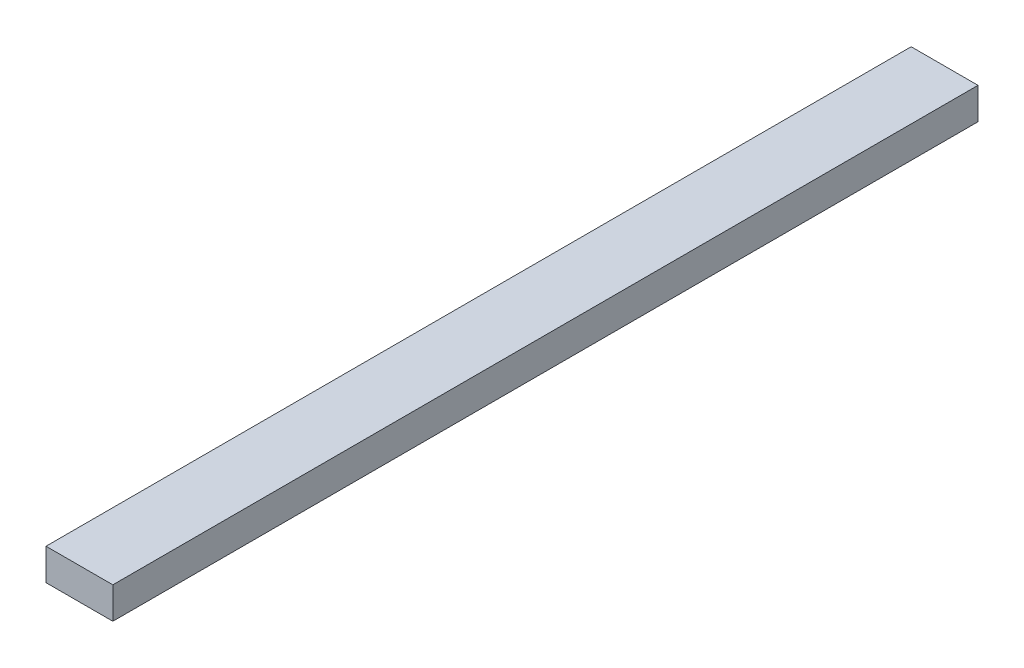
ISO-10303-21;
HEADER;
FILE_DESCRIPTION(('STEP AP214'),'2;1');
FILE_NAME('part.step','',(''),(''),'','','');
FILE_SCHEMA(('AUTOMOTIVE_DESIGN { 1 0 10303 214 1 1 1 1 }'));
ENDSEC;
DATA;
#1=APPLICATION_CONTEXT('core data for automotive mechanical design processes');
#2=APPLICATION_PROTOCOL_DEFINITION('international standard','automotive_design',2000,#1);
#3=PRODUCT_CONTEXT('',#1,'mechanical');
#4=PRODUCT('Part','Part','',(#3));
#5=PRODUCT_RELATED_PRODUCT_CATEGORY('part','',(#4));
#6=PRODUCT_DEFINITION_FORMATION('','',#4);
#7=PRODUCT_DEFINITION_CONTEXT('part definition',#1,'design');
#8=PRODUCT_DEFINITION('design','',#6,#7);
#9=PRODUCT_DEFINITION_SHAPE('','',#8);
#10=(LENGTH_UNIT() NAMED_UNIT(*) SI_UNIT(.MILLI.,.METRE.));
#11=(NAMED_UNIT(*) PLANE_ANGLE_UNIT() SI_UNIT($,.RADIAN.));
#12=(NAMED_UNIT(*) SI_UNIT($,.STERADIAN.) SOLID_ANGLE_UNIT());
#13=UNCERTAINTY_MEASURE_WITH_UNIT(LENGTH_MEASURE(1.E-05),#10,'distance_accuracy_value','');
#14=(GEOMETRIC_REPRESENTATION_CONTEXT(3) GLOBAL_UNCERTAINTY_ASSIGNED_CONTEXT((#13)) GLOBAL_UNIT_ASSIGNED_CONTEXT((#10,
#11,#12)) REPRESENTATION_CONTEXT('',''));
#15=CARTESIAN_POINT('',(0.,0.,0.));
#16=DIRECTION('',(0.,0.,1.));
#17=DIRECTION('',(1.,0.,0.));
#18=AXIS2_PLACEMENT_3D('',#15,#16,#17);
#19=CARTESIAN_POINT('',(-3.175,-1.5,82.2));
#20=DIRECTION('',(1.,0.,0.));
#21=DIRECTION('',(0.,0.,-1.));
#22=AXIS2_PLACEMENT_3D('',#19,#20,#21);
#23=PLANE('',#22);
#24=DIRECTION('',(0.,-1.,0.));
#25=VECTOR('',#24,1.);
#26=CARTESIAN_POINT('',(-3.175,-1.5,0.));
#27=LINE('',#26,#25);
#28=CARTESIAN_POINT('',(-3.175,1.5,0.));
#29=VERTEX_POINT('',#28);
#30=CARTESIAN_POINT('',(-3.175,-1.5,0.));
#31=VERTEX_POINT('',#30);
#32=EDGE_CURVE('E96',#29,#31,#27,.T.);
#33=ORIENTED_EDGE('',*,*,#32,.T.);
#34=DIRECTION('',(0.,0.,-1.));
#35=VECTOR('',#34,1.);
#36=CARTESIAN_POINT('',(-3.175,-1.5,82.2));
#37=LINE('',#36,#35);
#38=CARTESIAN_POINT('',(-3.175,-1.5,82.2));
#39=VERTEX_POINT('',#38);
#40=EDGE_CURVE('E11',#39,#31,#37,.T.);
#41=ORIENTED_EDGE('',*,*,#40,.F.);
#42=DIRECTION('',(0.,-1.,0.));
#43=VECTOR('',#42,1.);
#44=CARTESIAN_POINT('',(-3.175,-1.5,82.2));
#45=LINE('',#44,#43);
#46=CARTESIAN_POINT('',(-3.175,1.5,82.2));
#47=VERTEX_POINT('',#46);
#48=EDGE_CURVE('E84',#47,#39,#45,.T.);
#49=ORIENTED_EDGE('',*,*,#48,.F.);
#50=DIRECTION('',(0.,0.,-1.));
#51=VECTOR('',#50,1.);
#52=CARTESIAN_POINT('',(-3.175,1.5,82.2));
#53=LINE('',#52,#51);
#54=EDGE_CURVE('E92',#47,#29,#53,.T.);
#55=ORIENTED_EDGE('',*,*,#54,.T.);
#56=EDGE_LOOP('',(#33,#41,#49,#55));
#57=FACE_BOUND('',#56,.T.);
#58=ADVANCED_FACE('F33',(#57),#23,.F.);
#59=CARTESIAN_POINT('',(3.175,-1.5,82.2));
#60=DIRECTION('',(0.,1.,0.));
#61=DIRECTION('',(-1.,0.,0.));
#62=AXIS2_PLACEMENT_3D('',#59,#60,#61);
#63=PLANE('',#62);
#64=DIRECTION('',(1.,0.,0.));
#65=VECTOR('',#64,1.);
#66=CARTESIAN_POINT('',(3.175,-1.5,0.));
#67=LINE('',#66,#65);
#68=CARTESIAN_POINT('',(3.175,-1.5,0.));
#69=VERTEX_POINT('',#68);
#70=EDGE_CURVE('E88',#31,#69,#67,.T.);
#71=ORIENTED_EDGE('',*,*,#70,.T.);
#72=DIRECTION('',(0.,0.,-1.));
#73=VECTOR('',#72,1.);
#74=CARTESIAN_POINT('',(3.175,-1.5,82.2));
#75=LINE('',#74,#73);
#76=CARTESIAN_POINT('',(3.175,-1.5,82.2));
#77=VERTEX_POINT('',#76);
#78=EDGE_CURVE('E41',#77,#69,#75,.T.);
#79=ORIENTED_EDGE('',*,*,#78,.F.);
#80=DIRECTION('',(1.,0.,0.));
#81=VECTOR('',#80,1.);
#82=CARTESIAN_POINT('',(3.175,-1.5,82.2));
#83=LINE('',#82,#81);
#84=EDGE_CURVE('E79',#39,#77,#83,.T.);
#85=ORIENTED_EDGE('',*,*,#84,.F.);
#86=ORIENTED_EDGE('',*,*,#40,.T.);
#87=EDGE_LOOP('',(#71,#79,#85,#86));
#88=FACE_BOUND('',#87,.T.);
#89=ADVANCED_FACE('F87',(#88),#63,.F.);
#90=CARTESIAN_POINT('',(3.175,-1.5,82.2));
#91=DIRECTION('',(-1.,0.,0.));
#92=DIRECTION('',(0.,0.,1.));
#93=AXIS2_PLACEMENT_3D('',#90,#91,#92);
#94=PLANE('',#93);
#95=DIRECTION('',(0.,1.,0.));
#96=VECTOR('',#95,1.);
#97=CARTESIAN_POINT('',(3.175,-1.5,0.));
#98=LINE('',#97,#96);
#99=CARTESIAN_POINT('',(3.175,1.5,0.));
#100=VERTEX_POINT('',#99);
#101=EDGE_CURVE('E66',#69,#100,#98,.T.);
#102=ORIENTED_EDGE('',*,*,#101,.T.);
#103=DIRECTION('',(0.,0.,-1.));
#104=VECTOR('',#103,1.);
#105=CARTESIAN_POINT('',(3.175,1.5,82.2));
#106=LINE('',#105,#104);
#107=CARTESIAN_POINT('',(3.175,1.5,82.2));
#108=VERTEX_POINT('',#107);
#109=EDGE_CURVE('E89',#108,#100,#106,.T.);
#110=ORIENTED_EDGE('',*,*,#109,.F.);
#111=DIRECTION('',(0.,1.,0.));
#112=VECTOR('',#111,1.);
#113=CARTESIAN_POINT('',(3.175,-1.5,82.2));
#114=LINE('',#113,#112);
#115=EDGE_CURVE('E82',#77,#108,#114,.T.);
#116=ORIENTED_EDGE('',*,*,#115,.F.);
#117=ORIENTED_EDGE('',*,*,#78,.T.);
#118=EDGE_LOOP('',(#102,#110,#116,#117));
#119=FACE_BOUND('',#118,.T.);
#120=ADVANCED_FACE('F90',(#119),#94,.F.);
#121=CARTESIAN_POINT('',(3.175,1.5,82.2));
#122=DIRECTION('',(0.,-1.,0.));
#123=DIRECTION('',(1.,0.,0.));
#124=AXIS2_PLACEMENT_3D('',#121,#122,#123);
#125=PLANE('',#124);
#126=DIRECTION('',(-1.,0.,0.));
#127=VECTOR('',#126,1.);
#128=CARTESIAN_POINT('',(3.175,1.5,0.));
#129=LINE('',#128,#127);
#130=EDGE_CURVE('E72',#100,#29,#129,.T.);
#131=ORIENTED_EDGE('',*,*,#130,.T.);
#132=ORIENTED_EDGE('',*,*,#54,.F.);
#133=DIRECTION('',(-1.,0.,0.));
#134=VECTOR('',#133,1.);
#135=CARTESIAN_POINT('',(3.175,1.5,82.2));
#136=LINE('',#135,#134);
#137=EDGE_CURVE('E49',#108,#47,#136,.T.);
#138=ORIENTED_EDGE('',*,*,#137,.F.);
#139=ORIENTED_EDGE('',*,*,#109,.T.);
#140=EDGE_LOOP('',(#131,#132,#138,#139));
#141=FACE_BOUND('',#140,.T.);
#142=ADVANCED_FACE('F103',(#141),#125,.F.);
#143=CARTESIAN_POINT('',(0.,0.,82.2));
#144=DIRECTION('',(0.,0.,1.));
#145=DIRECTION('',(1.,0.,0.));
#146=AXIS2_PLACEMENT_3D('',#143,#144,#145);
#147=PLANE('',#146);
#148=ORIENTED_EDGE('',*,*,#48,.T.);
#149=ORIENTED_EDGE('',*,*,#84,.T.);
#150=ORIENTED_EDGE('',*,*,#115,.T.);
#151=ORIENTED_EDGE('',*,*,#137,.T.);
#152=EDGE_LOOP('',(#148,#149,#150,#151));
#153=FACE_BOUND('',#152,.T.);
#154=ADVANCED_FACE('F80',(#153),#147,.T.);
#155=CARTESIAN_POINT('',(0.,0.,0.));
#156=DIRECTION('',(0.,0.,1.));
#157=DIRECTION('',(1.,0.,0.));
#158=AXIS2_PLACEMENT_3D('',#155,#156,#157);
#159=PLANE('',#158);
#160=ORIENTED_EDGE('',*,*,#32,.F.);
#161=ORIENTED_EDGE('',*,*,#130,.F.);
#162=ORIENTED_EDGE('',*,*,#101,.F.);
#163=ORIENTED_EDGE('',*,*,#70,.F.);
#164=EDGE_LOOP('',(#160,#161,#162,#163));
#165=FACE_BOUND('',#164,.T.);
#166=ADVANCED_FACE('F106',(#165),#159,.F.);
#167=CLOSED_SHELL('',(#58,#89,#120,#142,#154,#166));
#168=MANIFOLD_SOLID_BREP('B2',#167);
#169=ADVANCED_BREP_SHAPE_REPRESENTATION('',(#18,#168),#14);
#170=SHAPE_DEFINITION_REPRESENTATION(#9,#169);
ENDSEC;
END-ISO-10303-21;
